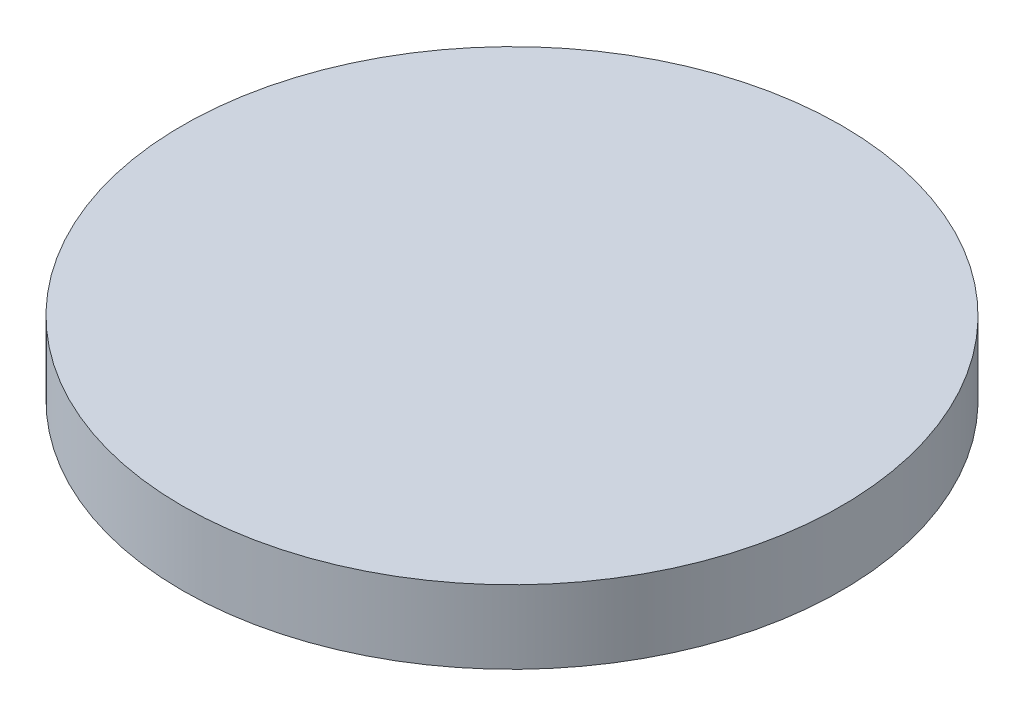
ISO-10303-21;
HEADER;
FILE_DESCRIPTION(('STEP AP214'),'2;1');
FILE_NAME('part.step','',(''),(''),'','','');
FILE_SCHEMA(('AUTOMOTIVE_DESIGN { 1 0 10303 214 1 1 1 1 }'));
ENDSEC;
DATA;
#1=APPLICATION_CONTEXT('core data for automotive mechanical design processes');
#2=APPLICATION_PROTOCOL_DEFINITION('international standard','automotive_design',2000,#1);
#3=PRODUCT_CONTEXT('',#1,'mechanical');
#4=PRODUCT('Part','Part','',(#3));
#5=PRODUCT_RELATED_PRODUCT_CATEGORY('part','',(#4));
#6=PRODUCT_DEFINITION_FORMATION('','',#4);
#7=PRODUCT_DEFINITION_CONTEXT('part definition',#1,'design');
#8=PRODUCT_DEFINITION('design','',#6,#7);
#9=PRODUCT_DEFINITION_SHAPE('','',#8);
#10=(LENGTH_UNIT() NAMED_UNIT(*) SI_UNIT(.MILLI.,.METRE.));
#11=(NAMED_UNIT(*) PLANE_ANGLE_UNIT() SI_UNIT($,.RADIAN.));
#12=(NAMED_UNIT(*) SI_UNIT($,.STERADIAN.) SOLID_ANGLE_UNIT());
#13=UNCERTAINTY_MEASURE_WITH_UNIT(LENGTH_MEASURE(1.E-05),#10,'distance_accuracy_value','');
#14=(GEOMETRIC_REPRESENTATION_CONTEXT(3) GLOBAL_UNCERTAINTY_ASSIGNED_CONTEXT((#13)) GLOBAL_UNIT_ASSIGNED_CONTEXT((#10,
#11,#12)) REPRESENTATION_CONTEXT('',''));
#15=CARTESIAN_POINT('',(0.,0.,0.));
#16=DIRECTION('',(0.,0.,1.));
#17=DIRECTION('',(1.,0.,0.));
#18=AXIS2_PLACEMENT_3D('',#15,#16,#17);
#19=CARTESIAN_POINT('',(0.,10.,0.));
#20=DIRECTION('',(0.,-1.,0.));
#21=DIRECTION('',(0.,0.,-1.));
#22=AXIS2_PLACEMENT_3D('',#19,#20,#21);
#23=CYLINDRICAL_SURFACE('',#22,45.);
#24=CARTESIAN_POINT('',(0.,10.,0.));
#25=DIRECTION('',(0.,1.,0.));
#26=DIRECTION('',(0.,0.,1.));
#27=AXIS2_PLACEMENT_3D('',#24,#25,#26);
#28=CIRCLE('',#27,45.);
#29=CARTESIAN_POINT('',(0.,10.,45.));
#30=VERTEX_POINT('',#29);
#31=EDGE_CURVE('E10',#30,#30,#28,.T.);
#32=ORIENTED_EDGE('',*,*,#31,.F.);
#33=EDGE_LOOP('',(#32));
#34=FACE_BOUND('',#33,.T.);
#35=CARTESIAN_POINT('',(0.,0.,0.));
#36=DIRECTION('',(0.,1.,0.));
#37=DIRECTION('',(0.,0.,1.));
#38=AXIS2_PLACEMENT_3D('',#35,#36,#37);
#39=CIRCLE('',#38,45.);
#40=CARTESIAN_POINT('',(0.,0.,45.));
#41=VERTEX_POINT('',#40);
#42=EDGE_CURVE('E34',#41,#41,#39,.T.);
#43=ORIENTED_EDGE('',*,*,#42,.T.);
#44=EDGE_LOOP('',(#43));
#45=FACE_BOUND('',#44,.T.);
#46=ADVANCED_FACE('F31',(#34,#45),#23,.T.);
#47=CARTESIAN_POINT('',(0.,10.,0.));
#48=DIRECTION('',(0.,1.,0.));
#49=DIRECTION('',(0.,0.,1.));
#50=AXIS2_PLACEMENT_3D('',#47,#48,#49);
#51=PLANE('',#50);
#52=ORIENTED_EDGE('',*,*,#31,.T.);
#53=EDGE_LOOP('',(#52));
#54=FACE_BOUND('',#53,.T.);
#55=ADVANCED_FACE('F46',(#54),#51,.T.);
#56=CARTESIAN_POINT('',(0.,0.,0.));
#57=DIRECTION('',(0.,1.,0.));
#58=DIRECTION('',(0.,0.,1.));
#59=AXIS2_PLACEMENT_3D('',#56,#57,#58);
#60=PLANE('',#59);
#61=ORIENTED_EDGE('',*,*,#42,.F.);
#62=EDGE_LOOP('',(#61));
#63=FACE_BOUND('',#62,.T.);
#64=ADVANCED_FACE('F44',(#63),#60,.F.);
#65=CLOSED_SHELL('',(#46,#55,#64));
#66=MANIFOLD_SOLID_BREP('B2',#65);
#67=ADVANCED_BREP_SHAPE_REPRESENTATION('',(#18,#66),#14);
#68=SHAPE_DEFINITION_REPRESENTATION(#9,#67);
ENDSEC;
END-ISO-10303-21;
